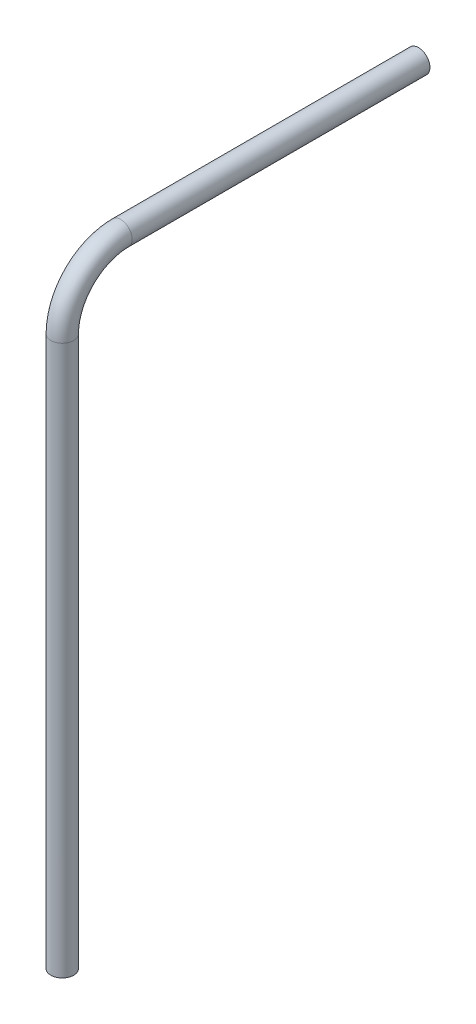
ISO-10303-21;
HEADER;
FILE_DESCRIPTION(('STEP AP214'),'2;1');
FILE_NAME('part.step','',(''),(''),'','','');
FILE_SCHEMA(('AUTOMOTIVE_DESIGN { 1 0 10303 214 1 1 1 1 }'));
ENDSEC;
DATA;
#1=APPLICATION_CONTEXT('core data for automotive mechanical design processes');
#2=APPLICATION_PROTOCOL_DEFINITION('international standard','automotive_design',2000,#1);
#3=PRODUCT_CONTEXT('',#1,'mechanical');
#4=PRODUCT('Part','Part','',(#3));
#5=PRODUCT_RELATED_PRODUCT_CATEGORY('part','',(#4));
#6=PRODUCT_DEFINITION_FORMATION('','',#4);
#7=PRODUCT_DEFINITION_CONTEXT('part definition',#1,'design');
#8=PRODUCT_DEFINITION('design','',#6,#7);
#9=PRODUCT_DEFINITION_SHAPE('','',#8);
#10=(LENGTH_UNIT() NAMED_UNIT(*) SI_UNIT(.MILLI.,.METRE.));
#11=(NAMED_UNIT(*) PLANE_ANGLE_UNIT() SI_UNIT($,.RADIAN.));
#12=(NAMED_UNIT(*) SI_UNIT($,.STERADIAN.) SOLID_ANGLE_UNIT());
#13=UNCERTAINTY_MEASURE_WITH_UNIT(LENGTH_MEASURE(1.E-05),#10,'distance_accuracy_value','');
#14=(GEOMETRIC_REPRESENTATION_CONTEXT(3) GLOBAL_UNCERTAINTY_ASSIGNED_CONTEXT((#13)) GLOBAL_UNIT_ASSIGNED_CONTEXT((#10,
#11,#12)) REPRESENTATION_CONTEXT('',''));
#15=CARTESIAN_POINT('',(0.,0.,0.));
#16=DIRECTION('',(0.,0.,1.));
#17=DIRECTION('',(1.,0.,0.));
#18=AXIS2_PLACEMENT_3D('',#15,#16,#17);
#19=CARTESIAN_POINT('',(0.,0.,0.));
#20=DIRECTION('',(-1.,0.,0.));
#21=DIRECTION('',(0.,0.,1.));
#22=AXIS2_PLACEMENT_3D('',#19,#20,#21);
#23=TOROIDAL_SURFACE('',#22,64.833774641659,12.7);
#24=CARTESIAN_POINT('',(0.,64.833774641659,0.));
#25=DIRECTION('',(0.,0.,-1.));
#26=DIRECTION('',(0.,1.,0.));
#27=AXIS2_PLACEMENT_3D('',#24,#25,#26);
#28=CIRCLE('',#27,12.7);
#29=CARTESIAN_POINT('',(0.,77.533774641659,0.));
#30=VERTEX_POINT('',#29);
#31=EDGE_CURVE('E132',#30,#30,#28,.T.);
#32=ORIENTED_EDGE('',*,*,#31,.F.);
#33=EDGE_LOOP('',(#32));
#34=FACE_BOUND('',#33,.T.);
#35=CARTESIAN_POINT('',(0.,0.,64.833774641659));
#36=DIRECTION('',(0.,-1.,0.));
#37=DIRECTION('',(0.,0.,-1.));
#38=AXIS2_PLACEMENT_3D('',#35,#36,#37);
#39=CIRCLE('',#38,12.7);
#40=CARTESIAN_POINT('',(-11.6673683045636,0.,69.85));
#41=VERTEX_POINT('',#40);
#42=CARTESIAN_POINT('',(-10.1118547881285,0.,57.15));
#43=VERTEX_POINT('',#42);
#44=EDGE_CURVE('E70',#41,#43,#39,.T.);
#45=ORIENTED_EDGE('',*,*,#44,.F.);
#46=EDGE_CURVE('E129',#43,#41,#39,.T.);
#47=ORIENTED_EDGE('',*,*,#46,.F.);
#48=EDGE_LOOP('',(#45,#47));
#49=FACE_BOUND('',#48,.T.);
#50=ADVANCED_FACE('F48',(#34,#49),#23,.T.);
#51=CARTESIAN_POINT('',(0.,0.,0.));
#52=DIRECTION('',(-1.,0.,0.));
#53=DIRECTION('',(0.,0.,1.));
#54=AXIS2_PLACEMENT_3D('',#51,#52,#53);
#55=TOROIDAL_SURFACE('',#54,64.833774641659,4.7625);
#56=CARTESIAN_POINT('',(0.,0.,64.833774641659));
#57=DIRECTION('',(0.,-1.,0.));
#58=DIRECTION('',(0.,0.,-1.));
#59=AXIS2_PLACEMENT_3D('',#56,#57,#58);
#60=CIRCLE('',#59,4.7625);
#61=CARTESIAN_POINT('',(0.,0.,69.596274641659));
#62=VERTEX_POINT('',#61);
#63=EDGE_CURVE('E125',#62,#62,#60,.T.);
#64=CARTESIAN_POINT('',(0.,64.833774641659,0.));
#65=DIRECTION('',(0.,0.,-1.));
#66=DIRECTION('',(0.,1.,0.));
#67=AXIS2_PLACEMENT_3D('',#64,#65,#66);
#68=CIRCLE('',#67,4.7625);
#69=CARTESIAN_POINT('',(0.,69.596274641659,0.));
#70=VERTEX_POINT('',#69);
#71=EDGE_CURVE('E138',#70,#70,#68,.F.);
#72=CARTESIAN_POINT('',(0.,0.,0.));
#73=DIRECTION('',(-1.,0.,0.));
#74=DIRECTION('',(0.,0.,1.));
#75=AXIS2_PLACEMENT_3D('',#72,#73,#74);
#76=CIRCLE('',#75,69.596274641659);
#77=EDGE_CURVE('',#62,#70,#76,.T.);
#78=ORIENTED_EDGE('',*,*,#63,.T.);
#79=ORIENTED_EDGE('',*,*,#71,.F.);
#80=ORIENTED_EDGE('',*,*,#77,.T.);
#81=ORIENTED_EDGE('',*,*,#77,.F.);
#82=EDGE_LOOP('',(#78,#80,#79,#81));
#83=FACE_BOUND('',#82,.T.);
#84=ADVANCED_FACE('F148',(#83),#55,.F.);
#85=CARTESIAN_POINT('',(0.,-609.6,64.833774641659));
#86=DIRECTION('',(0.,-1.,0.));
#87=DIRECTION('',(0.,0.,-1.));
#88=AXIS2_PLACEMENT_3D('',#85,#86,#87);
#89=PLANE('',#88);
#90=DIRECTION('',(-1.,0.,0.));
#91=VECTOR('',#90,1.);
#92=CARTESIAN_POINT('',(-6.35,-609.6,57.1500000000001));
#93=LINE('',#92,#91);
#94=CARTESIAN_POINT('',(-6.35,-609.6,57.1500000000001));
#95=VERTEX_POINT('',#94);
#96=CARTESIAN_POINT('',(-10.1118547881286,-609.6,57.1500000000001));
#97=VERTEX_POINT('',#96);
#98=EDGE_CURVE('E89',#95,#97,#93,.T.);
#99=ORIENTED_EDGE('',*,*,#98,.T.);
#100=CARTESIAN_POINT('',(0.,-609.6,64.833774641659));
#101=DIRECTION('',(0.,-1.,0.));
#102=DIRECTION('',(0.,0.,-1.));
#103=AXIS2_PLACEMENT_3D('',#100,#101,#102);
#104=CIRCLE('',#103,12.7);
#105=CARTESIAN_POINT('',(-11.6673683045636,-609.6,69.8500000000001));
#106=VERTEX_POINT('',#105);
#107=EDGE_CURVE('E130',#97,#106,#104,.T.);
#108=ORIENTED_EDGE('',*,*,#107,.T.);
#109=DIRECTION('',(-1.,0.,0.));
#110=VECTOR('',#109,1.);
#111=CARTESIAN_POINT('',(-6.35,-609.6,69.8500000000001));
#112=LINE('',#111,#110);
#113=CARTESIAN_POINT('',(-6.35,-609.6,69.8500000000001));
#114=VERTEX_POINT('',#113);
#115=EDGE_CURVE('E62',#114,#106,#112,.T.);
#116=ORIENTED_EDGE('',*,*,#115,.F.);
#117=DIRECTION('',(0.,0.,1.));
#118=VECTOR('',#117,1.);
#119=CARTESIAN_POINT('',(-6.35,-609.6,57.1500000000001));
#120=LINE('',#119,#118);
#121=EDGE_CURVE('E104',#95,#114,#120,.T.);
#122=ORIENTED_EDGE('',*,*,#121,.F.);
#123=EDGE_LOOP('',(#99,#108,#116,#122));
#124=FACE_BOUND('',#123,.T.);
#125=CARTESIAN_POINT('',(0.,-609.6,64.833774641659));
#126=DIRECTION('',(0.,-1.,0.));
#127=DIRECTION('',(0.,0.,-1.));
#128=AXIS2_PLACEMENT_3D('',#125,#126,#127);
#129=CIRCLE('',#128,4.7625);
#130=CARTESIAN_POINT('',(0.,-609.6,60.071274641659));
#131=VERTEX_POINT('',#130);
#132=EDGE_CURVE('E126',#131,#131,#129,.T.);
#133=ORIENTED_EDGE('',*,*,#132,.F.);
#134=EDGE_LOOP('',(#133));
#135=FACE_BOUND('',#134,.T.);
#136=ADVANCED_FACE('F107',(#124,#135),#89,.T.);
#137=CARTESIAN_POINT('',(0.,-609.6,64.833774641659));
#138=DIRECTION('',(0.,1.,0.));
#139=DIRECTION('',(0.,0.,1.));
#140=AXIS2_PLACEMENT_3D('',#137,#138,#139);
#141=CYLINDRICAL_SURFACE('',#140,12.7);
#142=ORIENTED_EDGE('',*,*,#107,.F.);
#143=DIRECTION('',(0.,1.,0.));
#144=VECTOR('',#143,1.);
#145=CARTESIAN_POINT('',(-10.1118547881286,-609.6,57.1500000000001));
#146=LINE('',#145,#144);
#147=EDGE_CURVE('E13',#97,#43,#146,.T.);
#148=ORIENTED_EDGE('',*,*,#147,.T.);
#149=ORIENTED_EDGE('',*,*,#46,.T.);
#150=DIRECTION('',(0.,1.,0.));
#151=VECTOR('',#150,1.);
#152=CARTESIAN_POINT('',(-11.6673683045636,-609.6,69.8500000000001));
#153=LINE('',#152,#151);
#154=EDGE_CURVE('E55',#41,#106,#153,.F.);
#155=ORIENTED_EDGE('',*,*,#154,.T.);
#156=EDGE_LOOP('',(#142,#148,#149,#155));
#157=FACE_BOUND('',#156,.T.);
#158=ADVANCED_FACE('F142',(#157),#141,.T.);
#159=CARTESIAN_POINT('',(0.,-609.6,64.833774641659));
#160=DIRECTION('',(0.,1.,0.));
#161=DIRECTION('',(0.,0.,1.));
#162=AXIS2_PLACEMENT_3D('',#159,#160,#161);
#163=CYLINDRICAL_SURFACE('',#162,4.7625);
#164=ORIENTED_EDGE('',*,*,#132,.T.);
#165=EDGE_LOOP('',(#164));
#166=FACE_BOUND('',#165,.T.);
#167=ORIENTED_EDGE('',*,*,#63,.F.);
#168=EDGE_LOOP('',(#167));
#169=FACE_BOUND('',#168,.T.);
#170=ADVANCED_FACE('F160',(#166,#169),#163,.F.);
#171=CARTESIAN_POINT('',(0.,64.833774641659,-330.2));
#172=DIRECTION('',(0.,0.,-1.));
#173=DIRECTION('',(0.,1.,0.));
#174=AXIS2_PLACEMENT_3D('',#171,#172,#173);
#175=PLANE('',#174);
#176=CARTESIAN_POINT('',(0.,64.833774641659,-330.2));
#177=DIRECTION('',(0.,0.,-1.));
#178=DIRECTION('',(0.,1.,0.));
#179=AXIS2_PLACEMENT_3D('',#176,#177,#178);
#180=CIRCLE('',#179,12.7);
#181=CARTESIAN_POINT('',(0.,77.533774641659,-330.2));
#182=VERTEX_POINT('',#181);
#183=EDGE_CURVE('E122',#182,#182,#180,.T.);
#184=ORIENTED_EDGE('',*,*,#183,.T.);
#185=EDGE_LOOP('',(#184));
#186=FACE_BOUND('',#185,.T.);
#187=CARTESIAN_POINT('',(0.,64.833774641659,-330.2));
#188=DIRECTION('',(0.,0.,-1.));
#189=DIRECTION('',(0.,1.,0.));
#190=AXIS2_PLACEMENT_3D('',#187,#188,#189);
#191=CIRCLE('',#190,4.7625);
#192=CARTESIAN_POINT('',(0.,69.596274641659,-330.2));
#193=VERTEX_POINT('',#192);
#194=EDGE_CURVE('E116',#193,#193,#191,.T.);
#195=ORIENTED_EDGE('',*,*,#194,.F.);
#196=EDGE_LOOP('',(#195));
#197=FACE_BOUND('',#196,.T.);
#198=ADVANCED_FACE('F165',(#186,#197),#175,.T.);
#199=CARTESIAN_POINT('',(0.,64.833774641659,-330.2));
#200=DIRECTION('',(0.,0.,1.));
#201=DIRECTION('',(0.,-1.,0.));
#202=AXIS2_PLACEMENT_3D('',#199,#200,#201);
#203=CYLINDRICAL_SURFACE('',#202,12.7);
#204=ORIENTED_EDGE('',*,*,#183,.F.);
#205=EDGE_LOOP('',(#204));
#206=FACE_BOUND('',#205,.T.);
#207=ORIENTED_EDGE('',*,*,#31,.T.);
#208=EDGE_LOOP('',(#207));
#209=FACE_BOUND('',#208,.T.);
#210=ADVANCED_FACE('F167',(#206,#209),#203,.T.);
#211=CARTESIAN_POINT('',(0.,64.833774641659,-330.2));
#212=DIRECTION('',(0.,0.,1.));
#213=DIRECTION('',(0.,-1.,0.));
#214=AXIS2_PLACEMENT_3D('',#211,#212,#213);
#215=CYLINDRICAL_SURFACE('',#214,4.7625);
#216=ORIENTED_EDGE('',*,*,#194,.T.);
#217=EDGE_LOOP('',(#216));
#218=FACE_BOUND('',#217,.T.);
#219=ORIENTED_EDGE('',*,*,#71,.T.);
#220=EDGE_LOOP('',(#219));
#221=FACE_BOUND('',#220,.T.);
#222=ADVANCED_FACE('F170',(#218,#221),#215,.F.);
#223=CARTESIAN_POINT('',(-6.35,-609.6,57.1500000000001));
#224=DIRECTION('',(0.,0.,-1.));
#225=DIRECTION('',(0.,1.,0.));
#226=AXIS2_PLACEMENT_3D('',#223,#224,#225);
#227=PLANE('',#226);
#228=ORIENTED_EDGE('',*,*,#98,.F.);
#229=DIRECTION('',(0.,-1.,0.));
#230=VECTOR('',#229,1.);
#231=CARTESIAN_POINT('',(-6.35,-609.6,57.1500000000001));
#232=LINE('',#231,#230);
#233=CARTESIAN_POINT('',(-6.35,0.,57.15));
#234=VERTEX_POINT('',#233);
#235=EDGE_CURVE('E92',#234,#95,#232,.T.);
#236=ORIENTED_EDGE('',*,*,#235,.F.);
#237=DIRECTION('',(-1.,0.,0.));
#238=VECTOR('',#237,1.);
#239=CARTESIAN_POINT('',(-6.35,0.,57.15));
#240=LINE('',#239,#238);
#241=EDGE_CURVE('E114',#234,#43,#240,.T.);
#242=ORIENTED_EDGE('',*,*,#241,.T.);
#243=ORIENTED_EDGE('',*,*,#147,.F.);
#244=EDGE_LOOP('',(#228,#236,#242,#243));
#245=FACE_BOUND('',#244,.T.);
#246=ADVANCED_FACE('F91',(#245),#227,.F.);
#247=CARTESIAN_POINT('',(-6.35,0.,57.15));
#248=DIRECTION('',(0.,1.,0.));
#249=DIRECTION('',(0.,0.,1.));
#250=AXIS2_PLACEMENT_3D('',#247,#248,#249);
#251=PLANE('',#250);
#252=ORIENTED_EDGE('',*,*,#241,.F.);
#253=DIRECTION('',(0.,0.,-1.));
#254=VECTOR('',#253,1.);
#255=CARTESIAN_POINT('',(-6.35,0.,57.15));
#256=LINE('',#255,#254);
#257=CARTESIAN_POINT('',(-6.35,0.,69.85));
#258=VERTEX_POINT('',#257);
#259=EDGE_CURVE('E98',#258,#234,#256,.T.);
#260=ORIENTED_EDGE('',*,*,#259,.F.);
#261=DIRECTION('',(-1.,0.,0.));
#262=VECTOR('',#261,1.);
#263=CARTESIAN_POINT('',(-6.35,0.,69.85));
#264=LINE('',#263,#262);
#265=EDGE_CURVE('E117',#258,#41,#264,.T.);
#266=ORIENTED_EDGE('',*,*,#265,.T.);
#267=ORIENTED_EDGE('',*,*,#44,.T.);
#268=EDGE_LOOP('',(#252,#260,#266,#267));
#269=FACE_BOUND('',#268,.T.);
#270=ADVANCED_FACE('F145',(#269),#251,.F.);
#271=CARTESIAN_POINT('',(-6.35,-609.6,69.8500000000001));
#272=DIRECTION('',(0.,0.,1.));
#273=DIRECTION('',(0.,-1.,0.));
#274=AXIS2_PLACEMENT_3D('',#271,#272,#273);
#275=PLANE('',#274);
#276=ORIENTED_EDGE('',*,*,#265,.F.);
#277=DIRECTION('',(0.,1.,0.));
#278=VECTOR('',#277,1.);
#279=CARTESIAN_POINT('',(-6.35,-609.6,69.8500000000001));
#280=LINE('',#279,#278);
#281=EDGE_CURVE('E109',#114,#258,#280,.T.);
#282=ORIENTED_EDGE('',*,*,#281,.F.);
#283=ORIENTED_EDGE('',*,*,#115,.T.);
#284=ORIENTED_EDGE('',*,*,#154,.F.);
#285=EDGE_LOOP('',(#276,#282,#283,#284));
#286=FACE_BOUND('',#285,.T.);
#287=ADVANCED_FACE('F144',(#286),#275,.F.);
#288=CARTESIAN_POINT('',(-6.35,0.,0.));
#289=DIRECTION('',(1.,0.,0.));
#290=DIRECTION('',(0.,0.,-1.));
#291=AXIS2_PLACEMENT_3D('',#288,#289,#290);
#292=PLANE('',#291);
#293=ORIENTED_EDGE('',*,*,#235,.T.);
#294=ORIENTED_EDGE('',*,*,#121,.T.);
#295=ORIENTED_EDGE('',*,*,#281,.T.);
#296=ORIENTED_EDGE('',*,*,#259,.T.);
#297=EDGE_LOOP('',(#293,#294,#295,#296));
#298=FACE_BOUND('',#297,.T.);
#299=ADVANCED_FACE('F102',(#298),#292,.F.);
#300=CLOSED_SHELL('',(#50,#84,#136,#158,#170,#198,#210,#222,#246,#270,#287,#299));
#301=MANIFOLD_SOLID_BREP('B2',#300);
#302=ADVANCED_BREP_SHAPE_REPRESENTATION('',(#18,#301),#14);
#303=SHAPE_DEFINITION_REPRESENTATION(#9,#302);
ENDSEC;
END-ISO-10303-21;
